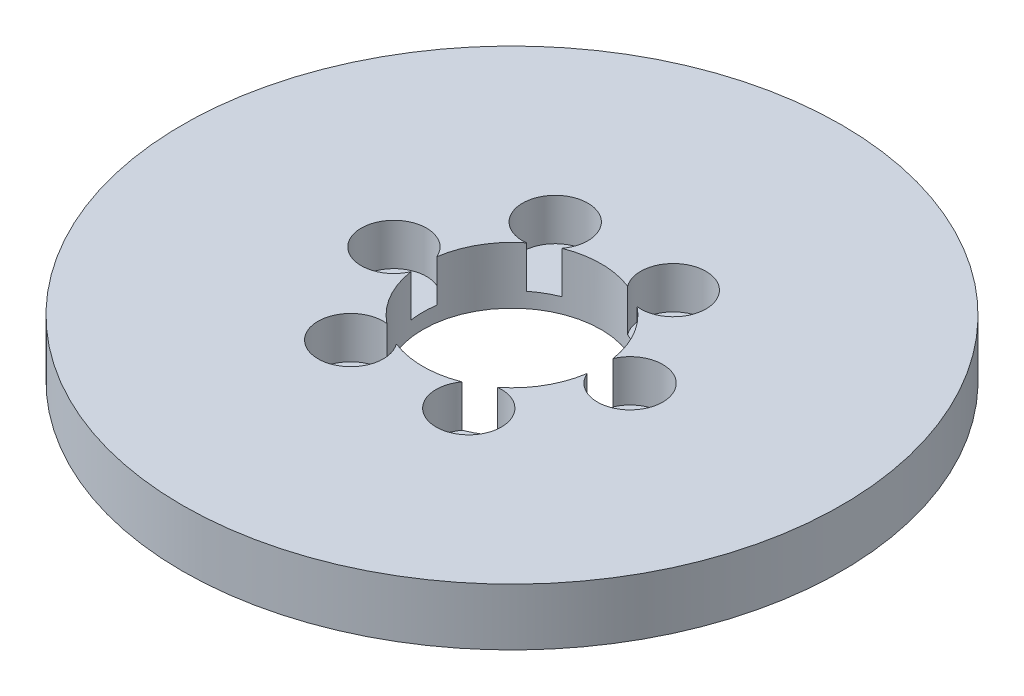
ISO-10303-21;
HEADER;
FILE_DESCRIPTION(('STEP AP214'),'2;1');
FILE_NAME('part.step','',(''),(''),'','','');
FILE_SCHEMA(('AUTOMOTIVE_DESIGN { 1 0 10303 214 1 1 1 1 }'));
ENDSEC;
DATA;
#1=APPLICATION_CONTEXT('core data for automotive mechanical design processes');
#2=APPLICATION_PROTOCOL_DEFINITION('international standard','automotive_design',2000,#1);
#3=PRODUCT_CONTEXT('',#1,'mechanical');
#4=PRODUCT('Part','Part','',(#3));
#5=PRODUCT_RELATED_PRODUCT_CATEGORY('part','',(#4));
#6=PRODUCT_DEFINITION_FORMATION('','',#4);
#7=PRODUCT_DEFINITION_CONTEXT('part definition',#1,'design');
#8=PRODUCT_DEFINITION('design','',#6,#7);
#9=PRODUCT_DEFINITION_SHAPE('','',#8);
#10=(LENGTH_UNIT() NAMED_UNIT(*) SI_UNIT(.MILLI.,.METRE.));
#11=(NAMED_UNIT(*) PLANE_ANGLE_UNIT() SI_UNIT($,.RADIAN.));
#12=(NAMED_UNIT(*) SI_UNIT($,.STERADIAN.) SOLID_ANGLE_UNIT());
#13=UNCERTAINTY_MEASURE_WITH_UNIT(LENGTH_MEASURE(1.E-05),#10,'distance_accuracy_value','');
#14=(GEOMETRIC_REPRESENTATION_CONTEXT(3) GLOBAL_UNCERTAINTY_ASSIGNED_CONTEXT((#13)) GLOBAL_UNIT_ASSIGNED_CONTEXT((#10,
#11,#12)) REPRESENTATION_CONTEXT('',''));
#15=CARTESIAN_POINT('',(0.,0.,0.));
#16=DIRECTION('',(0.,0.,1.));
#17=DIRECTION('',(1.,0.,0.));
#18=AXIS2_PLACEMENT_3D('',#15,#16,#17);
#19=CARTESIAN_POINT('',(0.,16.,0.));
#20=DIRECTION('',(0.,-1.,0.));
#21=DIRECTION('',(0.,0.,-1.));
#22=AXIS2_PLACEMENT_3D('',#19,#20,#21);
#23=CYLINDRICAL_SURFACE('',#22,92.5);
#24=CARTESIAN_POINT('',(0.,16.,0.));
#25=DIRECTION('',(0.,1.,0.));
#26=DIRECTION('',(0.,0.,1.));
#27=AXIS2_PLACEMENT_3D('',#24,#25,#26);
#28=CIRCLE('',#27,92.5);
#29=CARTESIAN_POINT('',(0.,16.,92.5));
#30=VERTEX_POINT('',#29);
#31=EDGE_CURVE('E171',#30,#30,#28,.T.);
#32=ORIENTED_EDGE('',*,*,#31,.F.);
#33=EDGE_LOOP('',(#32));
#34=FACE_BOUND('',#33,.T.);
#35=CARTESIAN_POINT('',(0.,0.,0.));
#36=DIRECTION('',(0.,1.,0.));
#37=DIRECTION('',(0.,0.,1.));
#38=AXIS2_PLACEMENT_3D('',#35,#36,#37);
#39=CIRCLE('',#38,92.5);
#40=CARTESIAN_POINT('',(0.,0.,92.5));
#41=VERTEX_POINT('',#40);
#42=EDGE_CURVE('E157',#41,#41,#39,.T.);
#43=ORIENTED_EDGE('',*,*,#42,.T.);
#44=EDGE_LOOP('',(#43));
#45=FACE_BOUND('',#44,.T.);
#46=ADVANCED_FACE('F39',(#34,#45),#23,.T.);
#47=CARTESIAN_POINT('',(0.,16.,0.));
#48=DIRECTION('',(0.,1.,0.));
#49=DIRECTION('',(0.,0.,1.));
#50=AXIS2_PLACEMENT_3D('',#47,#48,#49);
#51=PLANE('',#50);
#52=CARTESIAN_POINT('',(-16.5726130068795,16.,-28.7046077420913));
#53=DIRECTION('',(0.,1.,0.));
#54=DIRECTION('',(-0.866025403784433,0.,0.50000000000001));
#55=AXIS2_PLACEMENT_3D('',#52,#53,#54);
#56=CIRCLE('',#55,9.16458325821433);
#57=CARTESIAN_POINT('',(-9.21597028654941,16.,-23.2393177971609));
#58=VERTEX_POINT('',#57);
#59=CARTESIAN_POINT('',(-15.5178544356869,16.,-19.6009232872544));
#60=VERTEX_POINT('',#59);
#61=EDGE_CURVE('E214',#58,#60,#56,.T.);
#62=ORIENTED_EDGE('',*,*,#61,.F.);
#63=CARTESIAN_POINT('',(0.,16.,0.));
#64=DIRECTION('',(0.,1.,0.));
#65=DIRECTION('',(0.,0.,1.));
#66=AXIS2_PLACEMENT_3D('',#63,#64,#65);
#67=CIRCLE('',#66,25.);
#68=CARTESIAN_POINT('',(9.21597028654891,16.,-23.2393177971611));
#69=VERTEX_POINT('',#68);
#70=EDGE_CURVE('E272',#69,#58,#67,.T.);
#71=ORIENTED_EDGE('',*,*,#70,.F.);
#72=CARTESIAN_POINT('',(16.5726130068789,16.,-28.7046077420916));
#73=DIRECTION('',(0.,1.,0.));
#74=DIRECTION('',(-0.866025403784443,0.,-0.499999999999992));
#75=AXIS2_PLACEMENT_3D('',#72,#73,#74);
#76=CIRCLE('',#75,9.16458325821433);
#77=CARTESIAN_POINT('',(15.5178544356865,16.,-19.6009232872547));
#78=VERTEX_POINT('',#77);
#79=EDGE_CURVE('E285',#78,#69,#76,.T.);
#80=ORIENTED_EDGE('',*,*,#79,.F.);
#81=CARTESIAN_POINT('',(24.7338247222358,16.,-3.63839450990639));
#82=VERTEX_POINT('',#81);
#83=EDGE_CURVE('E165',#82,#78,#67,.T.);
#84=ORIENTED_EDGE('',*,*,#83,.F.);
#85=CARTESIAN_POINT('',(33.1452260137583,16.,0.));
#86=DIRECTION('',(0.,1.,0.));
#87=DIRECTION('',(0.,0.,-1.));
#88=AXIS2_PLACEMENT_3D('',#85,#86,#87);
#89=CIRCLE('',#88,9.16458325821433);
#90=CARTESIAN_POINT('',(24.7338247222358,16.,3.63839450990639));
#91=VERTEX_POINT('',#90);
#92=EDGE_CURVE('E281',#91,#82,#89,.T.);
#93=ORIENTED_EDGE('',*,*,#92,.F.);
#94=CARTESIAN_POINT('',(15.5178544356867,16.,19.6009232872545));
#95=VERTEX_POINT('',#94);
#96=EDGE_CURVE('E160',#95,#91,#67,.T.);
#97=ORIENTED_EDGE('',*,*,#96,.F.);
#98=CARTESIAN_POINT('',(16.5726130068793,16.,28.7046077420914));
#99=DIRECTION('',(0.,1.,0.));
#100=DIRECTION('',(0.866025403784436,0.,-0.500000000000004));
#101=AXIS2_PLACEMENT_3D('',#98,#99,#100);
#102=CIRCLE('',#101,9.16458325821433);
#103=CARTESIAN_POINT('',(9.21597028654926,16.,23.2393177971609));
#104=VERTEX_POINT('',#103);
#105=EDGE_CURVE('E154',#104,#95,#102,.T.);
#106=ORIENTED_EDGE('',*,*,#105,.F.);
#107=CARTESIAN_POINT('',(-9.21597028654909,16.,23.239317797161));
#108=VERTEX_POINT('',#107);
#109=EDGE_CURVE('E150',#108,#104,#67,.T.);
#110=ORIENTED_EDGE('',*,*,#109,.F.);
#111=CARTESIAN_POINT('',(-16.5726130068791,16.,28.7046077420915));
#112=DIRECTION('',(0.,1.,0.));
#113=DIRECTION('',(0.86602540378444,0.,0.499999999999998));
#114=AXIS2_PLACEMENT_3D('',#111,#112,#113);
#115=CIRCLE('',#114,9.16458325821433);
#116=CARTESIAN_POINT('',(-15.5178544356866,16.,19.6009232872546));
#117=VERTEX_POINT('',#116);
#118=EDGE_CURVE('E127',#117,#108,#115,.T.);
#119=ORIENTED_EDGE('',*,*,#118,.F.);
#120=CARTESIAN_POINT('',(-24.7338247222358,16.,3.63839450990639));
#121=VERTEX_POINT('',#120);
#122=EDGE_CURVE('E156',#121,#117,#67,.T.);
#123=ORIENTED_EDGE('',*,*,#122,.F.);
#124=CARTESIAN_POINT('',(-33.1452260137583,16.,0.));
#125=DIRECTION('',(0.,1.,0.));
#126=DIRECTION('',(0.,0.,1.));
#127=AXIS2_PLACEMENT_3D('',#124,#125,#126);
#128=CIRCLE('',#127,9.16458325821433);
#129=CARTESIAN_POINT('',(-24.7338247222358,16.,-3.63839450990639));
#130=VERTEX_POINT('',#129);
#131=EDGE_CURVE('E164',#130,#121,#128,.T.);
#132=ORIENTED_EDGE('',*,*,#131,.F.);
#133=EDGE_CURVE('E159',#60,#130,#67,.T.);
#134=ORIENTED_EDGE('',*,*,#133,.F.);
#135=EDGE_LOOP('',(#62,#71,#80,#84,#93,#97,#106,#110,#119,#123,#132,#134));
#136=FACE_BOUND('',#135,.T.);
#137=ORIENTED_EDGE('',*,*,#31,.T.);
#138=EDGE_LOOP('',(#137));
#139=FACE_BOUND('',#138,.T.);
#140=ADVANCED_FACE('F155',(#136,#139),#51,.T.);
#141=CARTESIAN_POINT('',(0.,0.,0.));
#142=DIRECTION('',(0.,1.,0.));
#143=DIRECTION('',(0.,0.,1.));
#144=AXIS2_PLACEMENT_3D('',#141,#142,#143);
#145=PLANE('',#144);
#146=CARTESIAN_POINT('',(0.,0.,0.));
#147=DIRECTION('',(0.,1.,0.));
#148=DIRECTION('',(0.,0.,1.));
#149=AXIS2_PLACEMENT_3D('',#146,#147,#148);
#150=CIRCLE('',#149,25.);
#151=CARTESIAN_POINT('',(0.,0.,25.));
#152=VERTEX_POINT('',#151);
#153=EDGE_CURVE('E170',#152,#152,#150,.T.);
#154=ORIENTED_EDGE('',*,*,#153,.T.);
#155=EDGE_LOOP('',(#154));
#156=FACE_BOUND('',#155,.T.);
#157=ORIENTED_EDGE('',*,*,#42,.F.);
#158=EDGE_LOOP('',(#157));
#159=FACE_BOUND('',#158,.T.);
#160=ADVANCED_FACE('F232',(#156,#159),#145,.F.);
#161=CARTESIAN_POINT('',(0.,16.,0.));
#162=DIRECTION('',(0.,-1.,0.));
#163=DIRECTION('',(0.,0.,-1.));
#164=AXIS2_PLACEMENT_3D('',#161,#162,#163);
#165=CYLINDRICAL_SURFACE('',#164,25.);
#166=DIRECTION('',(0.,1.,0.));
#167=VECTOR('',#166,1.);
#168=CARTESIAN_POINT('',(-9.21597028654942,10.1181956241517,-23.2393177971609));
#169=LINE('',#168,#167);
#170=CARTESIAN_POINT('',(-9.21597028654941,4.23639124830349,-23.2393177971609));
#171=VERTEX_POINT('',#170);
#172=EDGE_CURVE('E11',#171,#58,#169,.T.);
#173=ORIENTED_EDGE('',*,*,#172,.F.);
#174=CARTESIAN_POINT('',(0.,4.23639124830349,0.));
#175=DIRECTION('',(0.,1.,0.));
#176=DIRECTION('',(0.,0.,1.));
#177=AXIS2_PLACEMENT_3D('',#174,#175,#176);
#178=CIRCLE('',#177,25.);
#179=CARTESIAN_POINT('',(-15.5178544356869,4.23639124830349,-19.6009232872544));
#180=VERTEX_POINT('',#179);
#181=EDGE_CURVE('E209',#171,#180,#178,.T.);
#182=ORIENTED_EDGE('',*,*,#181,.T.);
#183=DIRECTION('',(0.,1.,0.));
#184=VECTOR('',#183,1.);
#185=CARTESIAN_POINT('',(-15.5178544356869,10.1181956241517,-19.6009232872544));
#186=LINE('',#185,#184);
#187=EDGE_CURVE('E46',#60,#180,#186,.F.);
#188=ORIENTED_EDGE('',*,*,#187,.F.);
#189=ORIENTED_EDGE('',*,*,#133,.T.);
#190=DIRECTION('',(0.,1.,0.));
#191=VECTOR('',#190,1.);
#192=CARTESIAN_POINT('',(-24.7338247222358,10.1181956241517,-3.63839450990638));
#193=LINE('',#192,#191);
#194=CARTESIAN_POINT('',(-24.7338247222358,4.23639124830349,-3.63839450990639));
#195=VERTEX_POINT('',#194);
#196=EDGE_CURVE('E185',#195,#130,#193,.T.);
#197=ORIENTED_EDGE('',*,*,#196,.F.);
#198=CARTESIAN_POINT('',(0.,4.23639124830349,0.));
#199=DIRECTION('',(0.,1.,0.));
#200=DIRECTION('',(0.,0.,1.));
#201=AXIS2_PLACEMENT_3D('',#198,#199,#200);
#202=CIRCLE('',#201,25.);
#203=CARTESIAN_POINT('',(-24.7338247222358,4.23639124830349,3.63839450990639));
#204=VERTEX_POINT('',#203);
#205=EDGE_CURVE('E173',#195,#204,#202,.T.);
#206=ORIENTED_EDGE('',*,*,#205,.T.);
#207=DIRECTION('',(0.,1.,0.));
#208=VECTOR('',#207,1.);
#209=CARTESIAN_POINT('',(-24.7338247222358,10.1181956241517,3.63839450990638));
#210=LINE('',#209,#208);
#211=EDGE_CURVE('E178',#121,#204,#210,.F.);
#212=ORIENTED_EDGE('',*,*,#211,.F.);
#213=ORIENTED_EDGE('',*,*,#122,.T.);
#214=DIRECTION('',(0.,1.,0.));
#215=VECTOR('',#214,1.);
#216=CARTESIAN_POINT('',(-15.5178544356866,10.1181956241517,19.6009232872546));
#217=LINE('',#216,#215);
#218=CARTESIAN_POINT('',(-15.5178544356866,4.23639124830349,19.6009232872546));
#219=VERTEX_POINT('',#218);
#220=EDGE_CURVE('E132',#219,#117,#217,.T.);
#221=ORIENTED_EDGE('',*,*,#220,.F.);
#222=CARTESIAN_POINT('',(0.,4.23639124830349,0.));
#223=DIRECTION('',(0.,1.,0.));
#224=DIRECTION('',(0.,0.,1.));
#225=AXIS2_PLACEMENT_3D('',#222,#223,#224);
#226=CIRCLE('',#225,25.);
#227=CARTESIAN_POINT('',(-9.21597028654909,4.23639124830349,23.239317797161));
#228=VERTEX_POINT('',#227);
#229=EDGE_CURVE('E146',#219,#228,#226,.T.);
#230=ORIENTED_EDGE('',*,*,#229,.T.);
#231=DIRECTION('',(0.,1.,0.));
#232=VECTOR('',#231,1.);
#233=CARTESIAN_POINT('',(-9.21597028654909,10.1181956241517,23.239317797161));
#234=LINE('',#233,#232);
#235=EDGE_CURVE('E128',#108,#228,#234,.F.);
#236=ORIENTED_EDGE('',*,*,#235,.F.);
#237=ORIENTED_EDGE('',*,*,#109,.T.);
#238=DIRECTION('',(0.,1.,0.));
#239=VECTOR('',#238,1.);
#240=CARTESIAN_POINT('',(9.21597028654926,10.1181956241517,23.2393177971609));
#241=LINE('',#240,#239);
#242=CARTESIAN_POINT('',(9.21597028654926,4.23639124830349,23.2393177971609));
#243=VERTEX_POINT('',#242);
#244=EDGE_CURVE('E192',#243,#104,#241,.T.);
#245=ORIENTED_EDGE('',*,*,#244,.F.);
#246=CARTESIAN_POINT('',(0.,4.23639124830349,0.));
#247=DIRECTION('',(0.,1.,0.));
#248=DIRECTION('',(0.,0.,1.));
#249=AXIS2_PLACEMENT_3D('',#246,#247,#248);
#250=CIRCLE('',#249,25.);
#251=CARTESIAN_POINT('',(15.5178544356867,4.23639124830349,19.6009232872545));
#252=VERTEX_POINT('',#251);
#253=EDGE_CURVE('E190',#243,#252,#250,.T.);
#254=ORIENTED_EDGE('',*,*,#253,.T.);
#255=DIRECTION('',(0.,1.,0.));
#256=VECTOR('',#255,1.);
#257=CARTESIAN_POINT('',(15.5178544356867,10.1181956241517,19.6009232872545));
#258=LINE('',#257,#256);
#259=EDGE_CURVE('E189',#95,#252,#258,.F.);
#260=ORIENTED_EDGE('',*,*,#259,.F.);
#261=ORIENTED_EDGE('',*,*,#96,.T.);
#262=DIRECTION('',(0.,1.,0.));
#263=VECTOR('',#262,1.);
#264=CARTESIAN_POINT('',(24.7338247222358,10.1181956241517,3.63839450990638));
#265=LINE('',#264,#263);
#266=CARTESIAN_POINT('',(24.7338247222358,4.23639124830349,3.63839450990639));
#267=VERTEX_POINT('',#266);
#268=EDGE_CURVE('E203',#267,#91,#265,.T.);
#269=ORIENTED_EDGE('',*,*,#268,.F.);
#270=CARTESIAN_POINT('',(0.,4.23639124830349,0.));
#271=DIRECTION('',(0.,1.,0.));
#272=DIRECTION('',(0.,0.,1.));
#273=AXIS2_PLACEMENT_3D('',#270,#271,#272);
#274=CIRCLE('',#273,25.);
#275=CARTESIAN_POINT('',(24.7338247222358,4.23639124830349,-3.63839450990639));
#276=VERTEX_POINT('',#275);
#277=EDGE_CURVE('E194',#267,#276,#274,.T.);
#278=ORIENTED_EDGE('',*,*,#277,.T.);
#279=DIRECTION('',(0.,1.,0.));
#280=VECTOR('',#279,1.);
#281=CARTESIAN_POINT('',(24.7338247222358,10.1181956241517,-3.63839450990638));
#282=LINE('',#281,#280);
#283=EDGE_CURVE('E196',#82,#276,#282,.F.);
#284=ORIENTED_EDGE('',*,*,#283,.F.);
#285=ORIENTED_EDGE('',*,*,#83,.T.);
#286=DIRECTION('',(0.,1.,0.));
#287=VECTOR('',#286,1.);
#288=CARTESIAN_POINT('',(15.5178544356865,10.1181956241517,-19.6009232872547));
#289=LINE('',#288,#287);
#290=CARTESIAN_POINT('',(15.5178544356865,4.23639124830349,-19.6009232872547));
#291=VERTEX_POINT('',#290);
#292=EDGE_CURVE('E208',#291,#78,#289,.T.);
#293=ORIENTED_EDGE('',*,*,#292,.F.);
#294=CARTESIAN_POINT('',(0.,4.23639124830349,0.));
#295=DIRECTION('',(0.,1.,0.));
#296=DIRECTION('',(0.,0.,1.));
#297=AXIS2_PLACEMENT_3D('',#294,#295,#296);
#298=CIRCLE('',#297,25.);
#299=CARTESIAN_POINT('',(9.21597028654891,4.23639124830349,-23.2393177971611));
#300=VERTEX_POINT('',#299);
#301=EDGE_CURVE('E201',#291,#300,#298,.T.);
#302=ORIENTED_EDGE('',*,*,#301,.T.);
#303=DIRECTION('',(0.,1.,0.));
#304=VECTOR('',#303,1.);
#305=CARTESIAN_POINT('',(9.21597028654891,10.1181956241517,-23.2393177971611));
#306=LINE('',#305,#304);
#307=EDGE_CURVE('E206',#69,#300,#306,.F.);
#308=ORIENTED_EDGE('',*,*,#307,.F.);
#309=ORIENTED_EDGE('',*,*,#70,.T.);
#310=EDGE_LOOP('',(#173,#182,#188,#189,#197,#206,#212,#213,#221,#230,#236,#237,#245,#254,#260,
#261,#269,#278,#284,#285,#293,#302,#308,#309));
#311=FACE_BOUND('',#310,.T.);
#312=ORIENTED_EDGE('',*,*,#153,.F.);
#313=EDGE_LOOP('',(#312));
#314=FACE_BOUND('',#313,.T.);
#315=ADVANCED_FACE('F145',(#311,#314),#165,.F.);
#316=CARTESIAN_POINT('',(-33.1452260137583,4.23639124830349,0.));
#317=DIRECTION('',(0.,1.,0.));
#318=DIRECTION('',(0.,0.,1.));
#319=AXIS2_PLACEMENT_3D('',#316,#317,#318);
#320=CYLINDRICAL_SURFACE('',#319,9.16458325821433);
#321=ORIENTED_EDGE('',*,*,#196,.T.);
#322=ORIENTED_EDGE('',*,*,#131,.T.);
#323=ORIENTED_EDGE('',*,*,#211,.T.);
#324=CARTESIAN_POINT('',(-33.1452260137583,4.23639124830349,0.));
#325=DIRECTION('',(0.,1.,0.));
#326=DIRECTION('',(0.,0.,1.));
#327=AXIS2_PLACEMENT_3D('',#324,#325,#326);
#328=CIRCLE('',#327,9.16458325821433);
#329=EDGE_CURVE('E168',#195,#204,#328,.T.);
#330=ORIENTED_EDGE('',*,*,#329,.F.);
#331=EDGE_LOOP('',(#321,#322,#323,#330));
#332=FACE_BOUND('',#331,.T.);
#333=ADVANCED_FACE('F243',(#332),#320,.F.);
#334=CARTESIAN_POINT('',(-33.1452260137583,4.23639124830349,0.));
#335=DIRECTION('',(0.,1.,0.));
#336=DIRECTION('',(0.,0.,1.));
#337=AXIS2_PLACEMENT_3D('',#334,#335,#336);
#338=PLANE('',#337);
#339=ORIENTED_EDGE('',*,*,#329,.T.);
#340=ORIENTED_EDGE('',*,*,#205,.F.);
#341=EDGE_LOOP('',(#339,#340));
#342=FACE_BOUND('',#341,.T.);
#343=ADVANCED_FACE('F247',(#342),#338,.T.);
#344=CARTESIAN_POINT('',(-16.5726130068791,4.23639124830349,28.7046077420915));
#345=DIRECTION('',(0.,1.,0.));
#346=DIRECTION('',(0.,0.,1.));
#347=AXIS2_PLACEMENT_3D('',#344,#345,#346);
#348=CYLINDRICAL_SURFACE('',#347,9.16458325821433);
#349=ORIENTED_EDGE('',*,*,#220,.T.);
#350=ORIENTED_EDGE('',*,*,#118,.T.);
#351=ORIENTED_EDGE('',*,*,#235,.T.);
#352=CARTESIAN_POINT('',(-16.5726130068791,4.23639124830349,28.7046077420915));
#353=DIRECTION('',(0.,1.,0.));
#354=DIRECTION('',(0.86602540378444,0.,0.499999999999998));
#355=AXIS2_PLACEMENT_3D('',#352,#353,#354);
#356=CIRCLE('',#355,9.16458325821433);
#357=EDGE_CURVE('E137',#219,#228,#356,.T.);
#358=ORIENTED_EDGE('',*,*,#357,.F.);
#359=EDGE_LOOP('',(#349,#350,#351,#358));
#360=FACE_BOUND('',#359,.T.);
#361=ADVANCED_FACE('F126',(#360),#348,.F.);
#362=CARTESIAN_POINT('',(-16.5726130068791,4.23639124830349,28.7046077420915));
#363=DIRECTION('',(0.,1.,0.));
#364=DIRECTION('',(0.86602540378444,0.,0.499999999999998));
#365=AXIS2_PLACEMENT_3D('',#362,#363,#364);
#366=PLANE('',#365);
#367=ORIENTED_EDGE('',*,*,#357,.T.);
#368=ORIENTED_EDGE('',*,*,#229,.F.);
#369=EDGE_LOOP('',(#367,#368));
#370=FACE_BOUND('',#369,.T.);
#371=ADVANCED_FACE('F254',(#370),#366,.T.);
#372=CARTESIAN_POINT('',(16.5726130068793,4.23639124830349,28.7046077420914));
#373=DIRECTION('',(0.,1.,0.));
#374=DIRECTION('',(0.,0.,1.));
#375=AXIS2_PLACEMENT_3D('',#372,#373,#374);
#376=CYLINDRICAL_SURFACE('',#375,9.16458325821433);
#377=ORIENTED_EDGE('',*,*,#244,.T.);
#378=ORIENTED_EDGE('',*,*,#105,.T.);
#379=ORIENTED_EDGE('',*,*,#259,.T.);
#380=CARTESIAN_POINT('',(16.5726130068793,4.23639124830349,28.7046077420914));
#381=DIRECTION('',(0.,1.,0.));
#382=DIRECTION('',(0.866025403784436,0.,-0.500000000000004));
#383=AXIS2_PLACEMENT_3D('',#380,#381,#382);
#384=CIRCLE('',#383,9.16458325821433);
#385=EDGE_CURVE('E138',#243,#252,#384,.T.);
#386=ORIENTED_EDGE('',*,*,#385,.F.);
#387=EDGE_LOOP('',(#377,#378,#379,#386));
#388=FACE_BOUND('',#387,.T.);
#389=ADVANCED_FACE('F260',(#388),#376,.F.);
#390=CARTESIAN_POINT('',(16.5726130068793,4.23639124830349,28.7046077420914));
#391=DIRECTION('',(0.,1.,0.));
#392=DIRECTION('',(0.866025403784436,0.,-0.500000000000004));
#393=AXIS2_PLACEMENT_3D('',#390,#391,#392);
#394=PLANE('',#393);
#395=ORIENTED_EDGE('',*,*,#385,.T.);
#396=ORIENTED_EDGE('',*,*,#253,.F.);
#397=EDGE_LOOP('',(#395,#396));
#398=FACE_BOUND('',#397,.T.);
#399=ADVANCED_FACE('F265',(#398),#394,.T.);
#400=CARTESIAN_POINT('',(33.1452260137583,4.23639124830349,0.));
#401=DIRECTION('',(0.,1.,0.));
#402=DIRECTION('',(0.,0.,1.));
#403=AXIS2_PLACEMENT_3D('',#400,#401,#402);
#404=CYLINDRICAL_SURFACE('',#403,9.16458325821433);
#405=ORIENTED_EDGE('',*,*,#268,.T.);
#406=ORIENTED_EDGE('',*,*,#92,.T.);
#407=ORIENTED_EDGE('',*,*,#283,.T.);
#408=CARTESIAN_POINT('',(33.1452260137583,4.23639124830349,0.));
#409=DIRECTION('',(0.,1.,0.));
#410=DIRECTION('',(0.,0.,-1.));
#411=AXIS2_PLACEMENT_3D('',#408,#409,#410);
#412=CIRCLE('',#411,9.16458325821433);
#413=EDGE_CURVE('E287',#267,#276,#412,.T.);
#414=ORIENTED_EDGE('',*,*,#413,.F.);
#415=EDGE_LOOP('',(#405,#406,#407,#414));
#416=FACE_BOUND('',#415,.T.);
#417=ADVANCED_FACE('F300',(#416),#404,.F.);
#418=CARTESIAN_POINT('',(33.1452260137583,4.23639124830349,0.));
#419=DIRECTION('',(0.,1.,0.));
#420=DIRECTION('',(0.,0.,-1.));
#421=AXIS2_PLACEMENT_3D('',#418,#419,#420);
#422=PLANE('',#421);
#423=ORIENTED_EDGE('',*,*,#413,.T.);
#424=ORIENTED_EDGE('',*,*,#277,.F.);
#425=EDGE_LOOP('',(#423,#424));
#426=FACE_BOUND('',#425,.T.);
#427=ADVANCED_FACE('F298',(#426),#422,.T.);
#428=CARTESIAN_POINT('',(16.5726130068789,4.23639124830349,-28.7046077420916));
#429=DIRECTION('',(0.,1.,0.));
#430=DIRECTION('',(0.,0.,1.));
#431=AXIS2_PLACEMENT_3D('',#428,#429,#430);
#432=CYLINDRICAL_SURFACE('',#431,9.16458325821433);
#433=ORIENTED_EDGE('',*,*,#292,.T.);
#434=ORIENTED_EDGE('',*,*,#79,.T.);
#435=ORIENTED_EDGE('',*,*,#307,.T.);
#436=CARTESIAN_POINT('',(16.5726130068789,4.23639124830349,-28.7046077420916));
#437=DIRECTION('',(0.,1.,0.));
#438=DIRECTION('',(-0.866025403784443,0.,-0.499999999999992));
#439=AXIS2_PLACEMENT_3D('',#436,#437,#438);
#440=CIRCLE('',#439,9.16458325821433);
#441=EDGE_CURVE('E56',#291,#300,#440,.T.);
#442=ORIENTED_EDGE('',*,*,#441,.F.);
#443=EDGE_LOOP('',(#433,#434,#435,#442));
#444=FACE_BOUND('',#443,.T.);
#445=ADVANCED_FACE('F301',(#444),#432,.F.);
#446=CARTESIAN_POINT('',(16.5726130068789,4.23639124830349,-28.7046077420916));
#447=DIRECTION('',(0.,1.,0.));
#448=DIRECTION('',(-0.866025403784443,0.,-0.499999999999992));
#449=AXIS2_PLACEMENT_3D('',#446,#447,#448);
#450=PLANE('',#449);
#451=ORIENTED_EDGE('',*,*,#441,.T.);
#452=ORIENTED_EDGE('',*,*,#301,.F.);
#453=EDGE_LOOP('',(#451,#452));
#454=FACE_BOUND('',#453,.T.);
#455=ADVANCED_FACE('F221',(#454),#450,.T.);
#456=CARTESIAN_POINT('',(-16.5726130068795,4.23639124830349,-28.7046077420913));
#457=DIRECTION('',(0.,1.,0.));
#458=DIRECTION('',(0.,0.,1.));
#459=AXIS2_PLACEMENT_3D('',#456,#457,#458);
#460=CYLINDRICAL_SURFACE('',#459,9.16458325821433);
#461=ORIENTED_EDGE('',*,*,#172,.T.);
#462=ORIENTED_EDGE('',*,*,#61,.T.);
#463=ORIENTED_EDGE('',*,*,#187,.T.);
#464=CARTESIAN_POINT('',(-16.5726130068795,4.23639124830349,-28.7046077420913));
#465=DIRECTION('',(0.,1.,0.));
#466=DIRECTION('',(-0.866025403784433,0.,0.50000000000001));
#467=AXIS2_PLACEMENT_3D('',#464,#465,#466);
#468=CIRCLE('',#467,9.16458325821433);
#469=EDGE_CURVE('E55',#171,#180,#468,.T.);
#470=ORIENTED_EDGE('',*,*,#469,.F.);
#471=EDGE_LOOP('',(#461,#462,#463,#470));
#472=FACE_BOUND('',#471,.T.);
#473=ADVANCED_FACE('F212',(#472),#460,.F.);
#474=CARTESIAN_POINT('',(-16.5726130068795,4.23639124830349,-28.7046077420913));
#475=DIRECTION('',(0.,1.,0.));
#476=DIRECTION('',(-0.866025403784433,0.,0.50000000000001));
#477=AXIS2_PLACEMENT_3D('',#474,#475,#476);
#478=PLANE('',#477);
#479=ORIENTED_EDGE('',*,*,#469,.T.);
#480=ORIENTED_EDGE('',*,*,#181,.F.);
#481=EDGE_LOOP('',(#479,#480));
#482=FACE_BOUND('',#481,.T.);
#483=ADVANCED_FACE('F217',(#482),#478,.T.);
#484=CLOSED_SHELL('',(#46,#140,#160,#315,#333,#343,#361,#371,#389,#399,#417,#427,#445,#455,#473,#483));
#485=MANIFOLD_SOLID_BREP('B2',#484);
#486=ADVANCED_BREP_SHAPE_REPRESENTATION('',(#18,#485),#14);
#487=SHAPE_DEFINITION_REPRESENTATION(#9,#486);
ENDSEC;
END-ISO-10303-21;
